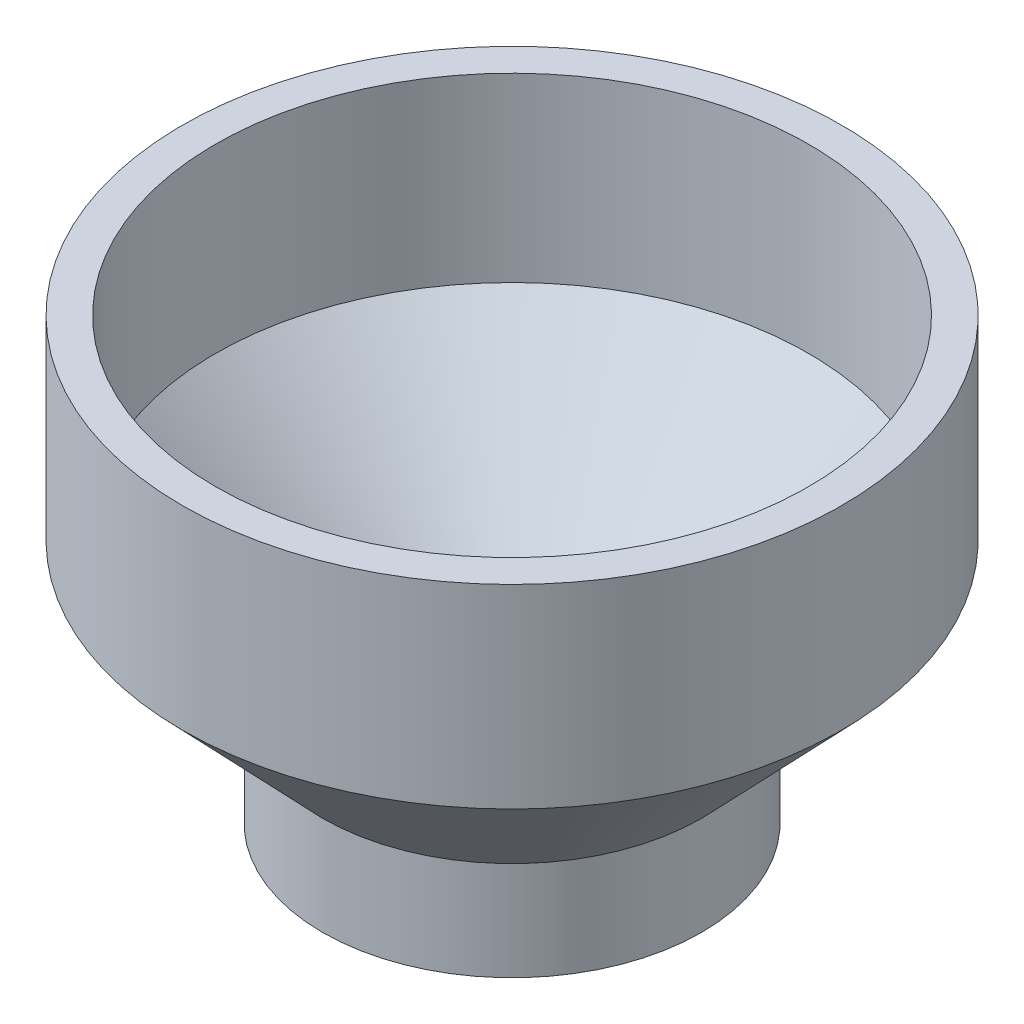
ISO-10303-21;
HEADER;
FILE_DESCRIPTION(('STEP AP214'),'2;1');
FILE_NAME('part.step','',(''),(''),'','','');
FILE_SCHEMA(('AUTOMOTIVE_DESIGN { 1 0 10303 214 1 1 1 1 }'));
ENDSEC;
DATA;
#1=APPLICATION_CONTEXT('core data for automotive mechanical design processes');
#2=APPLICATION_PROTOCOL_DEFINITION('international standard','automotive_design',2000,#1);
#3=PRODUCT_CONTEXT('',#1,'mechanical');
#4=PRODUCT('Part','Part','',(#3));
#5=PRODUCT_RELATED_PRODUCT_CATEGORY('part','',(#4));
#6=PRODUCT_DEFINITION_FORMATION('','',#4);
#7=PRODUCT_DEFINITION_CONTEXT('part definition',#1,'design');
#8=PRODUCT_DEFINITION('design','',#6,#7);
#9=PRODUCT_DEFINITION_SHAPE('','',#8);
#10=(LENGTH_UNIT() NAMED_UNIT(*) SI_UNIT(.MILLI.,.METRE.));
#11=(NAMED_UNIT(*) PLANE_ANGLE_UNIT() SI_UNIT($,.RADIAN.));
#12=(NAMED_UNIT(*) SI_UNIT($,.STERADIAN.) SOLID_ANGLE_UNIT());
#13=UNCERTAINTY_MEASURE_WITH_UNIT(LENGTH_MEASURE(1.E-05),#10,'distance_accuracy_value','');
#14=(GEOMETRIC_REPRESENTATION_CONTEXT(3) GLOBAL_UNCERTAINTY_ASSIGNED_CONTEXT((#13)) GLOBAL_UNIT_ASSIGNED_CONTEXT((#10,
#11,#12)) REPRESENTATION_CONTEXT('',''));
#15=CARTESIAN_POINT('',(0.,0.,0.));
#16=DIRECTION('',(0.,0.,1.));
#17=DIRECTION('',(1.,0.,0.));
#18=AXIS2_PLACEMENT_3D('',#15,#16,#17);
#19=CARTESIAN_POINT('',(0.,0.,0.));
#20=DIRECTION('',(0.,1.,0.));
#21=DIRECTION('',(0.,0.,1.));
#22=AXIS2_PLACEMENT_3D('',#19,#20,#21);
#23=CYLINDRICAL_SURFACE('',#22,57.15);
#24=CARTESIAN_POINT('',(0.,84.709,0.));
#25=DIRECTION('',(0.,1.,0.));
#26=DIRECTION('',(0.,0.,1.));
#27=AXIS2_PLACEMENT_3D('',#24,#25,#26);
#28=CIRCLE('',#27,57.15);
#29=CARTESIAN_POINT('',(0.,84.709,57.15));
#30=VERTEX_POINT('',#29);
#31=EDGE_CURVE('E75',#30,#30,#28,.T.);
#32=ORIENTED_EDGE('',*,*,#31,.T.);
#33=EDGE_LOOP('',(#32));
#34=FACE_BOUND('',#33,.T.);
#35=CARTESIAN_POINT('',(0.,49.784,0.));
#36=DIRECTION('',(0.,1.,0.));
#37=DIRECTION('',(0.,0.,1.));
#38=AXIS2_PLACEMENT_3D('',#35,#36,#37);
#39=CIRCLE('',#38,57.15);
#40=CARTESIAN_POINT('',(0.,49.784,57.15));
#41=VERTEX_POINT('',#40);
#42=EDGE_CURVE('E10',#41,#41,#39,.T.);
#43=ORIENTED_EDGE('',*,*,#42,.F.);
#44=EDGE_LOOP('',(#43));
#45=FACE_BOUND('',#44,.T.);
#46=ADVANCED_FACE('F41',(#34,#45),#23,.F.);
#47=CARTESIAN_POINT('',(0.,21.59,0.));
#48=DIRECTION('',(0.,1.,0.));
#49=DIRECTION('',(0.,0.,1.));
#50=AXIS2_PLACEMENT_3D('',#47,#48,#49);
#51=CONICAL_SURFACE('',#50,30.1625,0.763537434677479);
#52=ORIENTED_EDGE('',*,*,#42,.T.);
#53=EDGE_LOOP('',(#52));
#54=FACE_BOUND('',#53,.T.);
#55=CARTESIAN_POINT('',(0.,21.59,0.));
#56=DIRECTION('',(0.,1.,0.));
#57=DIRECTION('',(0.,0.,1.));
#58=AXIS2_PLACEMENT_3D('',#55,#56,#57);
#59=CIRCLE('',#58,30.1625);
#60=CARTESIAN_POINT('',(0.,21.59,30.1625));
#61=VERTEX_POINT('',#60);
#62=EDGE_CURVE('E48',#61,#61,#59,.T.);
#63=ORIENTED_EDGE('',*,*,#62,.F.);
#64=EDGE_LOOP('',(#63));
#65=FACE_BOUND('',#64,.T.);
#66=ADVANCED_FACE('F113',(#54,#65),#51,.F.);
#67=CARTESIAN_POINT('',(0.,0.,0.));
#68=DIRECTION('',(0.,1.,0.));
#69=DIRECTION('',(0.,0.,1.));
#70=AXIS2_PLACEMENT_3D('',#67,#68,#69);
#71=CYLINDRICAL_SURFACE('',#70,30.1625);
#72=ORIENTED_EDGE('',*,*,#62,.T.);
#73=EDGE_LOOP('',(#72));
#74=FACE_BOUND('',#73,.T.);
#75=CARTESIAN_POINT('',(0.,0.,0.));
#76=DIRECTION('',(0.,1.,0.));
#77=DIRECTION('',(0.,0.,1.));
#78=AXIS2_PLACEMENT_3D('',#75,#76,#77);
#79=CIRCLE('',#78,30.1625);
#80=CARTESIAN_POINT('',(0.,0.,30.1625));
#81=VERTEX_POINT('',#80);
#82=EDGE_CURVE('E55',#81,#81,#79,.T.);
#83=ORIENTED_EDGE('',*,*,#82,.F.);
#84=EDGE_LOOP('',(#83));
#85=FACE_BOUND('',#84,.T.);
#86=ADVANCED_FACE('F108',(#74,#85),#71,.F.);
#87=CARTESIAN_POINT('',(-30.1625,0.,0.));
#88=DIRECTION('',(0.,1.,0.));
#89=DIRECTION('',(0.,0.,1.));
#90=AXIS2_PLACEMENT_3D('',#87,#88,#89);
#91=PLANE('',#90);
#92=CARTESIAN_POINT('',(0.,0.,0.));
#93=DIRECTION('',(0.,1.,0.));
#94=DIRECTION('',(0.,0.,1.));
#95=AXIS2_PLACEMENT_3D('',#92,#93,#94);
#96=CIRCLE('',#95,36.5125);
#97=CARTESIAN_POINT('',(0.,0.,36.5125));
#98=VERTEX_POINT('',#97);
#99=EDGE_CURVE('E60',#98,#98,#96,.T.);
#100=ORIENTED_EDGE('',*,*,#99,.F.);
#101=EDGE_LOOP('',(#100));
#102=FACE_BOUND('',#101,.T.);
#103=ORIENTED_EDGE('',*,*,#82,.T.);
#104=EDGE_LOOP('',(#103));
#105=FACE_BOUND('',#104,.T.);
#106=ADVANCED_FACE('F102',(#102,#105),#91,.F.);
#107=CARTESIAN_POINT('',(0.,0.,0.));
#108=DIRECTION('',(0.,1.,0.));
#109=DIRECTION('',(0.,0.,1.));
#110=AXIS2_PLACEMENT_3D('',#107,#108,#109);
#111=CYLINDRICAL_SURFACE('',#110,36.5125);
#112=CARTESIAN_POINT('',(0.,19.0406968994798,0.));
#113=DIRECTION('',(0.,1.,0.));
#114=DIRECTION('',(0.,0.,1.));
#115=AXIS2_PLACEMENT_3D('',#112,#113,#114);
#116=CIRCLE('',#115,36.5125);
#117=CARTESIAN_POINT('',(0.,19.0406968994798,36.5125));
#118=VERTEX_POINT('',#117);
#119=EDGE_CURVE('E66',#118,#118,#116,.T.);
#120=ORIENTED_EDGE('',*,*,#119,.F.);
#121=EDGE_LOOP('',(#120));
#122=FACE_BOUND('',#121,.T.);
#123=ORIENTED_EDGE('',*,*,#99,.T.);
#124=EDGE_LOOP('',(#123));
#125=FACE_BOUND('',#124,.T.);
#126=ADVANCED_FACE('F96',(#122,#125),#111,.T.);
#127=CARTESIAN_POINT('',(0.,19.0406968994798,0.));
#128=DIRECTION('',(0.,1.,0.));
#129=DIRECTION('',(0.,0.,1.));
#130=AXIS2_PLACEMENT_3D('',#127,#128,#129);
#131=CONICAL_SURFACE('',#130,36.5125,0.763537434677478);
#132=CARTESIAN_POINT('',(0.,47.2346968994798,0.));
#133=DIRECTION('',(0.,1.,0.));
#134=DIRECTION('',(0.,0.,1.));
#135=AXIS2_PLACEMENT_3D('',#132,#133,#134);
#136=CIRCLE('',#135,63.5);
#137=CARTESIAN_POINT('',(0.,47.2346968994798,63.5));
#138=VERTEX_POINT('',#137);
#139=EDGE_CURVE('E69',#138,#138,#136,.T.);
#140=ORIENTED_EDGE('',*,*,#139,.F.);
#141=EDGE_LOOP('',(#140));
#142=FACE_BOUND('',#141,.T.);
#143=ORIENTED_EDGE('',*,*,#119,.T.);
#144=EDGE_LOOP('',(#143));
#145=FACE_BOUND('',#144,.T.);
#146=ADVANCED_FACE('F90',(#142,#145),#131,.T.);
#147=CARTESIAN_POINT('',(0.,0.,0.));
#148=DIRECTION('',(0.,1.,0.));
#149=DIRECTION('',(0.,0.,1.));
#150=AXIS2_PLACEMENT_3D('',#147,#148,#149);
#151=CYLINDRICAL_SURFACE('',#150,63.5);
#152=CARTESIAN_POINT('',(0.,84.709,0.));
#153=DIRECTION('',(0.,1.,0.));
#154=DIRECTION('',(0.,0.,1.));
#155=AXIS2_PLACEMENT_3D('',#152,#153,#154);
#156=CIRCLE('',#155,63.5);
#157=CARTESIAN_POINT('',(0.,84.709,63.5));
#158=VERTEX_POINT('',#157);
#159=EDGE_CURVE('E72',#158,#158,#156,.T.);
#160=ORIENTED_EDGE('',*,*,#159,.F.);
#161=EDGE_LOOP('',(#160));
#162=FACE_BOUND('',#161,.T.);
#163=ORIENTED_EDGE('',*,*,#139,.T.);
#164=EDGE_LOOP('',(#163));
#165=FACE_BOUND('',#164,.T.);
#166=ADVANCED_FACE('F84',(#162,#165),#151,.T.);
#167=CARTESIAN_POINT('',(-63.5,84.709,0.));
#168=DIRECTION('',(0.,-1.,0.));
#169=DIRECTION('',(0.,0.,-1.));
#170=AXIS2_PLACEMENT_3D('',#167,#168,#169);
#171=PLANE('',#170);
#172=ORIENTED_EDGE('',*,*,#31,.F.);
#173=EDGE_LOOP('',(#172));
#174=FACE_BOUND('',#173,.T.);
#175=ORIENTED_EDGE('',*,*,#159,.T.);
#176=EDGE_LOOP('',(#175));
#177=FACE_BOUND('',#176,.T.);
#178=ADVANCED_FACE('F81',(#174,#177),#171,.F.);
#179=CLOSED_SHELL('',(#46,#66,#86,#106,#126,#146,#166,#178));
#180=MANIFOLD_SOLID_BREP('B2',#179);
#181=ADVANCED_BREP_SHAPE_REPRESENTATION('',(#18,#180),#14);
#182=SHAPE_DEFINITION_REPRESENTATION(#9,#181);
ENDSEC;
END-ISO-10303-21;
